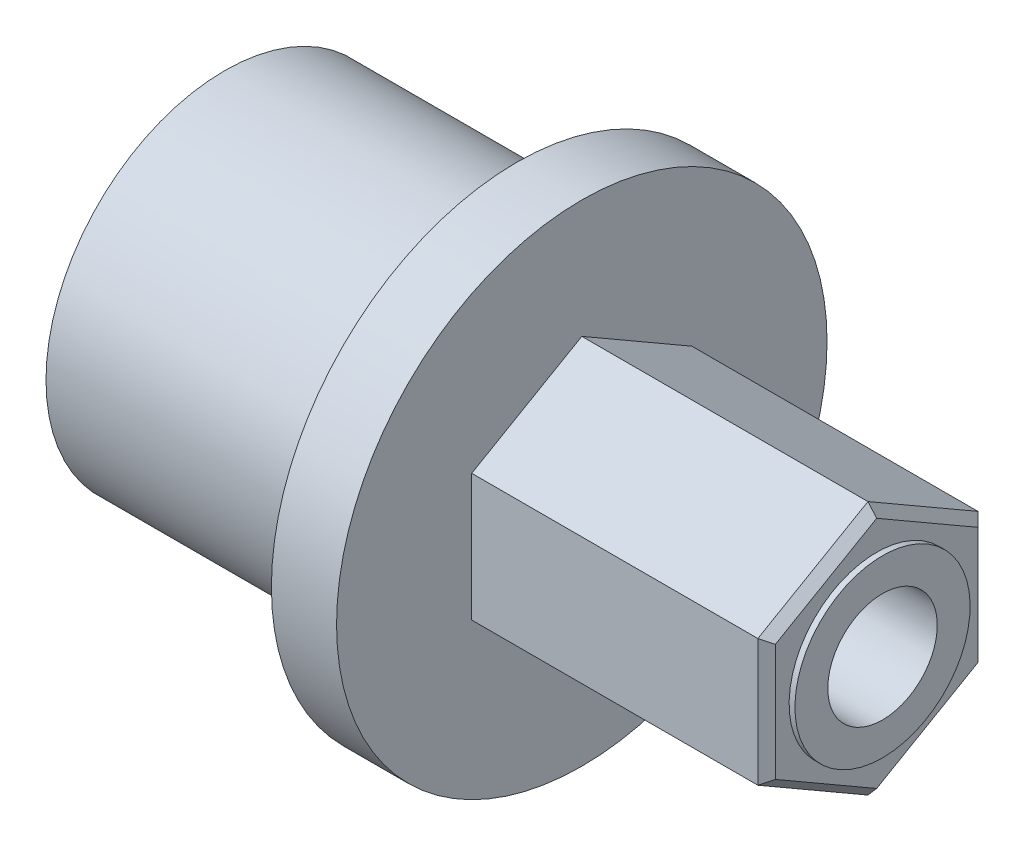
ISO-10303-21;
HEADER;
FILE_DESCRIPTION(('STEP AP214'),'2;1');
FILE_NAME('part.step','',(''),(''),'','','');
FILE_SCHEMA(('AUTOMOTIVE_DESIGN { 1 0 10303 214 1 1 1 1 }'));
ENDSEC;
DATA;
#1=APPLICATION_CONTEXT('core data for automotive mechanical design processes');
#2=APPLICATION_PROTOCOL_DEFINITION('international standard','automotive_design',2000,#1);
#3=PRODUCT_CONTEXT('',#1,'mechanical');
#4=PRODUCT('Part','Part','',(#3));
#5=PRODUCT_RELATED_PRODUCT_CATEGORY('part','',(#4));
#6=PRODUCT_DEFINITION_FORMATION('','',#4);
#7=PRODUCT_DEFINITION_CONTEXT('part definition',#1,'design');
#8=PRODUCT_DEFINITION('design','',#6,#7);
#9=PRODUCT_DEFINITION_SHAPE('','',#8);
#10=(LENGTH_UNIT() NAMED_UNIT(*) SI_UNIT(.MILLI.,.METRE.));
#11=(NAMED_UNIT(*) PLANE_ANGLE_UNIT() SI_UNIT($,.RADIAN.));
#12=(NAMED_UNIT(*) SI_UNIT($,.STERADIAN.) SOLID_ANGLE_UNIT());
#13=UNCERTAINTY_MEASURE_WITH_UNIT(LENGTH_MEASURE(1.E-05),#10,'distance_accuracy_value','');
#14=(GEOMETRIC_REPRESENTATION_CONTEXT(3) GLOBAL_UNCERTAINTY_ASSIGNED_CONTEXT((#13)) GLOBAL_UNIT_ASSIGNED_CONTEXT((#10,
#11,#12)) REPRESENTATION_CONTEXT('',''));
#15=CARTESIAN_POINT('',(0.,0.,0.));
#16=DIRECTION('',(0.,0.,1.));
#17=DIRECTION('',(1.,0.,0.));
#18=AXIS2_PLACEMENT_3D('',#15,#16,#17);
#19=CARTESIAN_POINT('',(-12.8778,10.668,0.));
#20=DIRECTION('',(-1.,0.,0.));
#21=DIRECTION('',(0.,-1.,0.));
#22=AXIS2_PLACEMENT_3D('',#19,#20,#21);
#23=PLANE('',#22);
#24=CARTESIAN_POINT('',(-12.8778,0.,0.));
#25=DIRECTION('',(-1.,0.,0.));
#26=DIRECTION('',(0.,-1.,0.));
#27=AXIS2_PLACEMENT_3D('',#24,#25,#26);
#28=CIRCLE('',#27,10.668);
#29=CARTESIAN_POINT('',(-12.8778,-10.668,0.));
#30=VERTEX_POINT('',#29);
#31=EDGE_CURVE('E171',#30,#30,#28,.T.);
#32=ORIENTED_EDGE('',*,*,#31,.F.);
#33=EDGE_LOOP('',(#32));
#34=FACE_BOUND('',#33,.T.);
#35=DIRECTION('',(0.,-0.5,0.866025403784439));
#36=VECTOR('',#35,1.);
#37=CARTESIAN_POINT('',(-12.8778,5.52859070770602,0.));
#38=LINE('',#37,#36);
#39=CARTESIAN_POINT('',(-12.8778,5.52859070770602,0.));
#40=VERTEX_POINT('',#39);
#41=CARTESIAN_POINT('',(-12.8778,2.76429535385301,4.7879));
#42=VERTEX_POINT('',#41);
#43=EDGE_CURVE('E110',#40,#42,#38,.T.);
#44=ORIENTED_EDGE('',*,*,#43,.F.);
#45=DIRECTION('',(0.,0.5,0.866025403784439));
#46=VECTOR('',#45,1.);
#47=CARTESIAN_POINT('',(-12.8778,2.76429535385301,-4.7879));
#48=LINE('',#47,#46);
#49=CARTESIAN_POINT('',(-12.8778,2.76429535385301,-4.7879));
#50=VERTEX_POINT('',#49);
#51=EDGE_CURVE('E121',#50,#40,#48,.T.);
#52=ORIENTED_EDGE('',*,*,#51,.F.);
#53=DIRECTION('',(0.,1.,0.));
#54=VECTOR('',#53,1.);
#55=CARTESIAN_POINT('',(-12.8778,-2.76429535385301,-4.7879));
#56=LINE('',#55,#54);
#57=CARTESIAN_POINT('',(-12.8778,-2.76429535385301,-4.7879));
#58=VERTEX_POINT('',#57);
#59=EDGE_CURVE('E136',#58,#50,#56,.T.);
#60=ORIENTED_EDGE('',*,*,#59,.F.);
#61=DIRECTION('',(0.,0.5,-0.866025403784439));
#62=VECTOR('',#61,1.);
#63=CARTESIAN_POINT('',(-12.8778,-5.52859070770602,0.));
#64=LINE('',#63,#62);
#65=CARTESIAN_POINT('',(-12.8778,-5.52859070770602,0.));
#66=VERTEX_POINT('',#65);
#67=EDGE_CURVE('E141',#66,#58,#64,.T.);
#68=ORIENTED_EDGE('',*,*,#67,.F.);
#69=DIRECTION('',(0.,-0.5,-0.866025403784439));
#70=VECTOR('',#69,1.);
#71=CARTESIAN_POINT('',(-12.8778,-2.76429535385301,4.7879));
#72=LINE('',#71,#70);
#73=CARTESIAN_POINT('',(-12.8778,-2.76429535385301,4.7879));
#74=VERTEX_POINT('',#73);
#75=EDGE_CURVE('E145',#74,#66,#72,.T.);
#76=ORIENTED_EDGE('',*,*,#75,.F.);
#77=DIRECTION('',(0.,-1.,0.));
#78=VECTOR('',#77,1.);
#79=CARTESIAN_POINT('',(-12.8778,2.76429535385301,4.7879));
#80=LINE('',#79,#78);
#81=EDGE_CURVE('E125',#42,#74,#80,.T.);
#82=ORIENTED_EDGE('',*,*,#81,.F.);
#83=EDGE_LOOP('',(#44,#52,#60,#68,#76,#82));
#84=FACE_BOUND('',#83,.T.);
#85=ADVANCED_FACE('F35',(#34,#84),#23,.F.);
#86=CARTESIAN_POINT('',(-22.598839252879,0.,0.));
#87=DIRECTION('',(-1.,0.,0.));
#88=DIRECTION('',(0.,-1.,0.));
#89=AXIS2_PLACEMENT_3D('',#86,#87,#88);
#90=CYLINDRICAL_SURFACE('',#89,3.81);
#91=CARTESIAN_POINT('',(0.203200000000001,0.,0.));
#92=DIRECTION('',(-1.,0.,0.));
#93=DIRECTION('',(0.,-1.,0.));
#94=AXIS2_PLACEMENT_3D('',#91,#92,#93);
#95=CIRCLE('',#94,3.81);
#96=CARTESIAN_POINT('',(0.203200000000001,-3.81,0.));
#97=VERTEX_POINT('',#96);
#98=EDGE_CURVE('E168',#97,#97,#95,.T.);
#99=ORIENTED_EDGE('',*,*,#98,.T.);
#100=EDGE_LOOP('',(#99));
#101=FACE_BOUND('',#100,.T.);
#102=CARTESIAN_POINT('',(-0.0508000000000002,0.,0.));
#103=DIRECTION('',(-1.,0.,0.));
#104=DIRECTION('',(0.,-1.,0.));
#105=AXIS2_PLACEMENT_3D('',#102,#103,#104);
#106=CIRCLE('',#105,3.81);
#107=CARTESIAN_POINT('',(-0.0507999999999997,-3.81,0.));
#108=VERTEX_POINT('',#107);
#109=EDGE_CURVE('E174',#108,#108,#106,.T.);
#110=ORIENTED_EDGE('',*,*,#109,.F.);
#111=EDGE_LOOP('',(#110));
#112=FACE_BOUND('',#111,.T.);
#113=ADVANCED_FACE('F252',(#101,#112),#90,.T.);
#114=CARTESIAN_POINT('',(-22.598839252879,0.,0.));
#115=DIRECTION('',(-1.,0.,0.));
#116=DIRECTION('',(0.,-1.,0.));
#117=AXIS2_PLACEMENT_3D('',#114,#115,#116);
#118=CYLINDRICAL_SURFACE('',#117,10.668);
#119=CARTESIAN_POINT('',(-15.7121190817378,0.,0.));
#120=DIRECTION('',(-1.,0.,0.));
#121=DIRECTION('',(0.,-1.,0.));
#122=AXIS2_PLACEMENT_3D('',#119,#120,#121);
#123=CIRCLE('',#122,10.668);
#124=CARTESIAN_POINT('',(-15.7121190817378,-10.668,0.));
#125=VERTEX_POINT('',#124);
#126=EDGE_CURVE('E131',#125,#125,#123,.T.);
#127=ORIENTED_EDGE('',*,*,#126,.F.);
#128=EDGE_LOOP('',(#127));
#129=FACE_BOUND('',#128,.T.);
#130=ORIENTED_EDGE('',*,*,#31,.T.);
#131=EDGE_LOOP('',(#130));
#132=FACE_BOUND('',#131,.T.);
#133=ADVANCED_FACE('F258',(#129,#132),#118,.T.);
#134=CARTESIAN_POINT('',(0.2032,3.81,0.));
#135=DIRECTION('',(-1.,0.,0.));
#136=DIRECTION('',(0.,-1.,0.));
#137=AXIS2_PLACEMENT_3D('',#134,#135,#136);
#138=PLANE('',#137);
#139=ORIENTED_EDGE('',*,*,#98,.F.);
#140=EDGE_LOOP('',(#139));
#141=FACE_BOUND('',#140,.T.);
#142=CARTESIAN_POINT('',(0.203200000000001,0.,0.));
#143=DIRECTION('',(-1.,0.,0.));
#144=DIRECTION('',(0.,-1.,0.));
#145=AXIS2_PLACEMENT_3D('',#142,#143,#144);
#146=CIRCLE('',#145,2.38125);
#147=CARTESIAN_POINT('',(0.203200000000001,-2.38125,0.));
#148=VERTEX_POINT('',#147);
#149=EDGE_CURVE('E165',#148,#148,#146,.T.);
#150=ORIENTED_EDGE('',*,*,#149,.T.);
#151=EDGE_LOOP('',(#150));
#152=FACE_BOUND('',#151,.T.);
#153=ADVANCED_FACE('F266',(#141,#152),#138,.F.);
#154=CARTESIAN_POINT('',(-22.598839252879,0.,0.));
#155=DIRECTION('',(-1.,0.,0.));
#156=DIRECTION('',(0.,-1.,0.));
#157=AXIS2_PLACEMENT_3D('',#154,#155,#156);
#158=CYLINDRICAL_SURFACE('',#157,2.38125);
#159=ORIENTED_EDGE('',*,*,#149,.F.);
#160=EDGE_LOOP('',(#159));
#161=FACE_BOUND('',#160,.T.);
#162=CARTESIAN_POINT('',(-24.0369690817378,0.,0.));
#163=DIRECTION('',(-1.,0.,0.));
#164=DIRECTION('',(0.,-1.,0.));
#165=AXIS2_PLACEMENT_3D('',#162,#163,#164);
#166=CIRCLE('',#165,2.38125);
#167=CARTESIAN_POINT('',(-24.0369690817378,-2.38125,0.));
#168=VERTEX_POINT('',#167);
#169=EDGE_CURVE('E162',#168,#168,#166,.T.);
#170=ORIENTED_EDGE('',*,*,#169,.T.);
#171=EDGE_LOOP('',(#170));
#172=FACE_BOUND('',#171,.T.);
#173=ADVANCED_FACE('F305',(#161,#172),#158,.F.);
#174=CARTESIAN_POINT('',(-28.4121190817378,0.,0.));
#175=DIRECTION('',(-1.,0.,0.));
#176=DIRECTION('',(0.,-1.,0.));
#177=AXIS2_PLACEMENT_3D('',#174,#175,#176);
#178=CONICAL_SURFACE('',#177,6.7564,0.78539816339745);
#179=ORIENTED_EDGE('',*,*,#169,.F.);
#180=EDGE_LOOP('',(#179));
#181=FACE_BOUND('',#180,.T.);
#182=CARTESIAN_POINT('',(-28.4121190817378,0.,0.));
#183=DIRECTION('',(-1.,0.,0.));
#184=DIRECTION('',(0.,-1.,0.));
#185=AXIS2_PLACEMENT_3D('',#182,#183,#184);
#186=CIRCLE('',#185,6.7564);
#187=CARTESIAN_POINT('',(-28.4121190817378,-6.7564,0.));
#188=VERTEX_POINT('',#187);
#189=EDGE_CURVE('E159',#188,#188,#186,.T.);
#190=ORIENTED_EDGE('',*,*,#189,.T.);
#191=EDGE_LOOP('',(#190));
#192=FACE_BOUND('',#191,.T.);
#193=ADVANCED_FACE('F301',(#181,#192),#178,.F.);
#194=CARTESIAN_POINT('',(-28.4121190817378,7.7724,0.));
#195=DIRECTION('',(1.,0.,0.));
#196=DIRECTION('',(0.,1.,0.));
#197=AXIS2_PLACEMENT_3D('',#194,#195,#196);
#198=PLANE('',#197);
#199=ORIENTED_EDGE('',*,*,#189,.F.);
#200=EDGE_LOOP('',(#199));
#201=FACE_BOUND('',#200,.T.);
#202=CARTESIAN_POINT('',(-28.4121190817378,0.,0.));
#203=DIRECTION('',(-1.,0.,0.));
#204=DIRECTION('',(0.,-1.,0.));
#205=AXIS2_PLACEMENT_3D('',#202,#203,#204);
#206=CIRCLE('',#205,7.7724);
#207=CARTESIAN_POINT('',(-28.4121190817378,-7.7724,0.));
#208=VERTEX_POINT('',#207);
#209=EDGE_CURVE('E156',#208,#208,#206,.T.);
#210=ORIENTED_EDGE('',*,*,#209,.T.);
#211=EDGE_LOOP('',(#210));
#212=FACE_BOUND('',#211,.T.);
#213=ADVANCED_FACE('F297',(#201,#212),#198,.F.);
#214=CARTESIAN_POINT('',(-22.598839252879,0.,0.));
#215=DIRECTION('',(-1.,0.,0.));
#216=DIRECTION('',(0.,-1.,0.));
#217=AXIS2_PLACEMENT_3D('',#214,#215,#216);
#218=CYLINDRICAL_SURFACE('',#217,7.7724);
#219=ORIENTED_EDGE('',*,*,#209,.F.);
#220=EDGE_LOOP('',(#219));
#221=FACE_BOUND('',#220,.T.);
#222=CARTESIAN_POINT('',(-15.7121190817378,0.,0.));
#223=DIRECTION('',(-1.,0.,0.));
#224=DIRECTION('',(0.,-1.,0.));
#225=AXIS2_PLACEMENT_3D('',#222,#223,#224);
#226=CIRCLE('',#225,7.7724);
#227=CARTESIAN_POINT('',(-15.7121190817378,-7.7724,0.));
#228=VERTEX_POINT('',#227);
#229=EDGE_CURVE('E134',#228,#228,#226,.T.);
#230=ORIENTED_EDGE('',*,*,#229,.T.);
#231=EDGE_LOOP('',(#230));
#232=FACE_BOUND('',#231,.T.);
#233=ADVANCED_FACE('F293',(#221,#232),#218,.T.);
#234=CARTESIAN_POINT('',(-15.7121190817378,7.7724,0.));
#235=DIRECTION('',(1.,0.,0.));
#236=DIRECTION('',(0.,1.,0.));
#237=AXIS2_PLACEMENT_3D('',#234,#235,#236);
#238=PLANE('',#237);
#239=ORIENTED_EDGE('',*,*,#229,.F.);
#240=EDGE_LOOP('',(#239));
#241=FACE_BOUND('',#240,.T.);
#242=ORIENTED_EDGE('',*,*,#126,.T.);
#243=EDGE_LOOP('',(#242));
#244=FACE_BOUND('',#243,.T.);
#245=ADVANCED_FACE('F249',(#241,#244),#238,.F.);
#246=CARTESIAN_POINT('',(14.8304761132527,5.52859070770602,0.));
#247=DIRECTION('',(0.,-0.866025403784439,-0.5));
#248=DIRECTION('',(0.,0.5,-0.866025403784439));
#249=AXIS2_PLACEMENT_3D('',#246,#247,#248);
#250=PLANE('',#249);
#251=DIRECTION('',(-1.,0.,0.));
#252=VECTOR('',#251,1.);
#253=CARTESIAN_POINT('',(14.8304761132527,2.76429535385301,4.7879));
#254=LINE('',#253,#252);
#255=CARTESIAN_POINT('',(-0.431799999999993,2.76429535385301,4.7879));
#256=VERTEX_POINT('',#255);
#257=EDGE_CURVE('E126',#256,#42,#254,.T.);
#258=ORIENTED_EDGE('',*,*,#257,.F.);
#259=DIRECTION('',(0.,0.5,-0.866025403784439));
#260=VECTOR('',#259,1.);
#261=CARTESIAN_POINT('',(-0.431799999999993,5.52859070770602,0.));
#262=LINE('',#261,#260);
#263=CARTESIAN_POINT('',(-0.431799999999993,5.52859070770602,0.));
#264=VERTEX_POINT('',#263);
#265=EDGE_CURVE('E12',#256,#264,#262,.T.);
#266=ORIENTED_EDGE('',*,*,#265,.T.);
#267=DIRECTION('',(-1.,0.,0.));
#268=VECTOR('',#267,1.);
#269=CARTESIAN_POINT('',(14.8304761132527,5.52859070770602,0.));
#270=LINE('',#269,#268);
#271=EDGE_CURVE('E107',#264,#40,#270,.T.);
#272=ORIENTED_EDGE('',*,*,#271,.T.);
#273=ORIENTED_EDGE('',*,*,#43,.T.);
#274=EDGE_LOOP('',(#258,#266,#272,#273));
#275=FACE_BOUND('',#274,.T.);
#276=ADVANCED_FACE('F109',(#275),#250,.F.);
#277=CARTESIAN_POINT('',(14.8304761132527,2.76429535385301,4.7879));
#278=DIRECTION('',(0.,0.,-1.));
#279=DIRECTION('',(-1.,0.,0.));
#280=AXIS2_PLACEMENT_3D('',#277,#278,#279);
#281=PLANE('',#280);
#282=DIRECTION('',(-1.,0.,0.));
#283=VECTOR('',#282,1.);
#284=CARTESIAN_POINT('',(14.8304761132527,-2.764295353853,4.7879));
#285=LINE('',#284,#283);
#286=CARTESIAN_POINT('',(-0.431799999999993,-2.76429535385301,4.7879));
#287=VERTEX_POINT('',#286);
#288=EDGE_CURVE('E148',#287,#74,#285,.T.);
#289=ORIENTED_EDGE('',*,*,#288,.F.);
#290=DIRECTION('',(0.,1.,0.));
#291=VECTOR('',#290,1.);
#292=CARTESIAN_POINT('',(-0.431799999999993,2.76429535385301,4.7879));
#293=LINE('',#292,#291);
#294=EDGE_CURVE('E44',#287,#256,#293,.T.);
#295=ORIENTED_EDGE('',*,*,#294,.T.);
#296=ORIENTED_EDGE('',*,*,#257,.T.);
#297=ORIENTED_EDGE('',*,*,#81,.T.);
#298=EDGE_LOOP('',(#289,#295,#296,#297));
#299=FACE_BOUND('',#298,.T.);
#300=ADVANCED_FACE('F241',(#299),#281,.F.);
#301=CARTESIAN_POINT('',(14.8304761132527,-2.764295353853,4.7879));
#302=DIRECTION('',(0.,0.866025403784439,-0.5));
#303=DIRECTION('',(0.,0.5,0.866025403784439));
#304=AXIS2_PLACEMENT_3D('',#301,#302,#303);
#305=PLANE('',#304);
#306=DIRECTION('',(-1.,0.,0.));
#307=VECTOR('',#306,1.);
#308=CARTESIAN_POINT('',(14.8304761132527,-5.52859070770601,0.));
#309=LINE('',#308,#307);
#310=CARTESIAN_POINT('',(-0.431799999999993,-5.52859070770601,0.));
#311=VERTEX_POINT('',#310);
#312=EDGE_CURVE('E144',#311,#66,#309,.T.);
#313=ORIENTED_EDGE('',*,*,#312,.F.);
#314=DIRECTION('',(0.,0.5,0.866025403784439));
#315=VECTOR('',#314,1.);
#316=CARTESIAN_POINT('',(-0.431799999999993,-2.76429535385301,4.7879));
#317=LINE('',#316,#315);
#318=EDGE_CURVE('E59',#311,#287,#317,.T.);
#319=ORIENTED_EDGE('',*,*,#318,.T.);
#320=ORIENTED_EDGE('',*,*,#288,.T.);
#321=ORIENTED_EDGE('',*,*,#75,.T.);
#322=EDGE_LOOP('',(#313,#319,#320,#321));
#323=FACE_BOUND('',#322,.T.);
#324=ADVANCED_FACE('F240',(#323),#305,.F.);
#325=CARTESIAN_POINT('',(14.8304761132527,-5.52859070770601,0.));
#326=DIRECTION('',(0.,0.866025403784439,0.5));
#327=DIRECTION('',(0.,-0.5,0.866025403784439));
#328=AXIS2_PLACEMENT_3D('',#325,#326,#327);
#329=PLANE('',#328);
#330=DIRECTION('',(-1.,0.,0.));
#331=VECTOR('',#330,1.);
#332=CARTESIAN_POINT('',(14.8304761132527,-2.764295353853,-4.7879));
#333=LINE('',#332,#331);
#334=CARTESIAN_POINT('',(-0.431799999999991,-2.76429535385301,-4.7879));
#335=VERTEX_POINT('',#334);
#336=EDGE_CURVE('E140',#335,#58,#333,.T.);
#337=ORIENTED_EDGE('',*,*,#336,.F.);
#338=DIRECTION('',(0.,-0.5,0.866025403784439));
#339=VECTOR('',#338,1.);
#340=CARTESIAN_POINT('',(-0.431799999999991,-5.52859070770601,0.));
#341=LINE('',#340,#339);
#342=EDGE_CURVE('E194',#335,#311,#341,.T.);
#343=ORIENTED_EDGE('',*,*,#342,.T.);
#344=ORIENTED_EDGE('',*,*,#312,.T.);
#345=ORIENTED_EDGE('',*,*,#67,.T.);
#346=EDGE_LOOP('',(#337,#343,#344,#345));
#347=FACE_BOUND('',#346,.T.);
#348=ADVANCED_FACE('F239',(#347),#329,.F.);
#349=CARTESIAN_POINT('',(14.8304761132527,-2.764295353853,-4.7879));
#350=DIRECTION('',(0.,0.,1.));
#351=DIRECTION('',(0.,-1.,0.));
#352=AXIS2_PLACEMENT_3D('',#349,#350,#351);
#353=PLANE('',#352);
#354=DIRECTION('',(-1.,0.,0.));
#355=VECTOR('',#354,1.);
#356=CARTESIAN_POINT('',(14.8304761132527,2.76429535385301,-4.7879));
#357=LINE('',#356,#355);
#358=CARTESIAN_POINT('',(-0.431799999999993,2.76429535385301,-4.7879));
#359=VERTEX_POINT('',#358);
#360=EDGE_CURVE('E130',#359,#50,#357,.T.);
#361=ORIENTED_EDGE('',*,*,#360,.F.);
#362=DIRECTION('',(0.,-1.,0.));
#363=VECTOR('',#362,1.);
#364=CARTESIAN_POINT('',(-0.431799999999993,-2.76429535385301,-4.7879));
#365=LINE('',#364,#363);
#366=EDGE_CURVE('E192',#359,#335,#365,.T.);
#367=ORIENTED_EDGE('',*,*,#366,.T.);
#368=ORIENTED_EDGE('',*,*,#336,.T.);
#369=ORIENTED_EDGE('',*,*,#59,.T.);
#370=EDGE_LOOP('',(#361,#367,#368,#369));
#371=FACE_BOUND('',#370,.T.);
#372=ADVANCED_FACE('F235',(#371),#353,.F.);
#373=CARTESIAN_POINT('',(14.8304761132527,2.76429535385301,-4.7879));
#374=DIRECTION('',(0.,-0.866025403784439,0.5));
#375=DIRECTION('',(0.,-0.5,-0.866025403784439));
#376=AXIS2_PLACEMENT_3D('',#373,#374,#375);
#377=PLANE('',#376);
#378=ORIENTED_EDGE('',*,*,#271,.F.);
#379=DIRECTION('',(0.,-0.5,-0.866025403784439));
#380=VECTOR('',#379,1.);
#381=CARTESIAN_POINT('',(-0.431799999999993,2.76429535385301,-4.7879));
#382=LINE('',#381,#380);
#383=EDGE_CURVE('E177',#264,#359,#382,.T.);
#384=ORIENTED_EDGE('',*,*,#383,.T.);
#385=ORIENTED_EDGE('',*,*,#360,.T.);
#386=ORIENTED_EDGE('',*,*,#51,.T.);
#387=EDGE_LOOP('',(#378,#384,#385,#386));
#388=FACE_BOUND('',#387,.T.);
#389=ADVANCED_FACE('F128',(#388),#377,.F.);
#390=CARTESIAN_POINT('',(-0.0507999999999998,3.81,0.));
#391=DIRECTION('',(-1.,0.,0.));
#392=DIRECTION('',(0.,-1.,0.));
#393=AXIS2_PLACEMENT_3D('',#390,#391,#392);
#394=PLANE('',#393);
#395=DIRECTION('',(0.,1.,0.));
#396=VECTOR('',#395,1.);
#397=CARTESIAN_POINT('',(-0.0507999999999998,3.81,-4.4069));
#398=LINE('',#397,#396);
#399=CARTESIAN_POINT('',(-0.0507999999999991,-2.54432490129176,-4.40690000000001));
#400=VERTEX_POINT('',#399);
#401=CARTESIAN_POINT('',(-0.0507999999999997,2.54432490129177,-4.4069));
#402=VERTEX_POINT('',#401);
#403=EDGE_CURVE('E187',#400,#402,#398,.T.);
#404=ORIENTED_EDGE('',*,*,#403,.T.);
#405=DIRECTION('',(0.,0.5,0.866025403784439));
#406=VECTOR('',#405,1.);
#407=CARTESIAN_POINT('',(-0.0507999999999999,4.76898735193765,-0.553671605790646));
#408=LINE('',#407,#406);
#409=CARTESIAN_POINT('',(-0.0507999999999999,5.08864980258353,0.));
#410=VERTEX_POINT('',#409);
#411=EDGE_CURVE('E189',#402,#410,#408,.T.);
#412=ORIENTED_EDGE('',*,*,#411,.T.);
#413=DIRECTION('',(0.,-0.5,0.866025403784439));
#414=VECTOR('',#413,1.);
#415=CARTESIAN_POINT('',(-0.0507999999999999,4.76898735193765,0.553671605790646));
#416=LINE('',#415,#414);
#417=CARTESIAN_POINT('',(-0.0507999999999997,2.54432490129177,4.4069));
#418=VERTEX_POINT('',#417);
#419=EDGE_CURVE('E179',#410,#418,#416,.T.);
#420=ORIENTED_EDGE('',*,*,#419,.T.);
#421=DIRECTION('',(0.,-1.,0.));
#422=VECTOR('',#421,1.);
#423=CARTESIAN_POINT('',(-0.0507999999999998,3.81,4.4069));
#424=LINE('',#423,#422);
#425=CARTESIAN_POINT('',(-0.0507999999999991,-2.54432490129176,4.4069));
#426=VERTEX_POINT('',#425);
#427=EDGE_CURVE('E181',#418,#426,#424,.T.);
#428=ORIENTED_EDGE('',*,*,#427,.T.);
#429=DIRECTION('',(0.,-0.5,-0.866025403784439));
#430=VECTOR('',#429,1.);
#431=CARTESIAN_POINT('',(-0.050799999999999,-2.86398735193764,3.85322839420936));
#432=LINE('',#431,#430);
#433=CARTESIAN_POINT('',(-0.0507999999999988,-5.08864980258353,0.));
#434=VERTEX_POINT('',#433);
#435=EDGE_CURVE('E183',#426,#434,#432,.T.);
#436=ORIENTED_EDGE('',*,*,#435,.T.);
#437=DIRECTION('',(0.,0.5,-0.866025403784439));
#438=VECTOR('',#437,1.);
#439=CARTESIAN_POINT('',(-0.050799999999999,-2.86398735193765,-3.85322839420936));
#440=LINE('',#439,#438);
#441=EDGE_CURVE('E185',#434,#400,#440,.T.);
#442=ORIENTED_EDGE('',*,*,#441,.T.);
#443=EDGE_LOOP('',(#404,#412,#420,#428,#436,#442));
#444=FACE_BOUND('',#443,.T.);
#445=ORIENTED_EDGE('',*,*,#109,.T.);
#446=EDGE_LOOP('',(#445));
#447=FACE_BOUND('',#446,.T.);
#448=ADVANCED_FACE('F222',(#444,#447),#394,.F.);
#449=CARTESIAN_POINT('',(-0.431799999999993,-2.76429535385301,4.7879));
#450=DIRECTION('',(-0.707106781186546,0.612372435695795,-0.353553390593274));
#451=DIRECTION('',(0.,0.5,0.866025403784439));
#452=AXIS2_PLACEMENT_3D('',#449,#450,#451);
#453=PLANE('',#452);
#454=DIRECTION('',(0.654653670707978,0.755928946018454,0.));
#455=VECTOR('',#454,1.);
#456=CARTESIAN_POINT('',(0.93617142857144,-3.94899336264715,0.));
#457=LINE('',#456,#455);
#458=EDGE_CURVE('E207',#434,#311,#457,.F.);
#459=ORIENTED_EDGE('',*,*,#458,.F.);
#460=ORIENTED_EDGE('',*,*,#435,.F.);
#461=DIRECTION('',(0.654653670707977,0.377964473009225,-0.654653670707978));
#462=VECTOR('',#461,1.);
#463=CARTESIAN_POINT('',(0.936171428571428,-1.97449668132358,3.41992857142858));
#464=LINE('',#463,#462);
#465=EDGE_CURVE('E39',#287,#426,#464,.T.);
#466=ORIENTED_EDGE('',*,*,#465,.F.);
#467=ORIENTED_EDGE('',*,*,#318,.F.);
#468=EDGE_LOOP('',(#459,#460,#466,#467));
#469=FACE_BOUND('',#468,.T.);
#470=ADVANCED_FACE('F37',(#469),#453,.F.);
#471=CARTESIAN_POINT('',(-0.431799999999993,2.76429535385301,4.7879));
#472=DIRECTION('',(-0.707106781186548,0.,-0.707106781186547));
#473=DIRECTION('',(0.,1.,0.));
#474=AXIS2_PLACEMENT_3D('',#471,#472,#473);
#475=PLANE('',#474);
#476=ORIENTED_EDGE('',*,*,#465,.T.);
#477=ORIENTED_EDGE('',*,*,#427,.F.);
#478=DIRECTION('',(0.654653670707977,-0.377964473009228,-0.654653670707977));
#479=VECTOR('',#478,1.);
#480=CARTESIAN_POINT('',(0.936171428571433,1.97449668132358,3.41992857142857));
#481=LINE('',#480,#479);
#482=EDGE_CURVE('E205',#256,#418,#481,.T.);
#483=ORIENTED_EDGE('',*,*,#482,.F.);
#484=ORIENTED_EDGE('',*,*,#294,.F.);
#485=EDGE_LOOP('',(#476,#477,#483,#484));
#486=FACE_BOUND('',#485,.T.);
#487=ADVANCED_FACE('F217',(#486),#475,.F.);
#488=CARTESIAN_POINT('',(-0.431799999999991,-5.52859070770601,0.));
#489=DIRECTION('',(-0.707106781186547,0.612372435695795,0.353553390593274));
#490=DIRECTION('',(0.,-0.5,0.866025403784439));
#491=AXIS2_PLACEMENT_3D('',#488,#489,#490);
#492=PLANE('',#491);
#493=ORIENTED_EDGE('',*,*,#458,.T.);
#494=ORIENTED_EDGE('',*,*,#342,.F.);
#495=DIRECTION('',(0.654653670707978,0.377964473009227,0.654653670707977));
#496=VECTOR('',#495,1.);
#497=CARTESIAN_POINT('',(0.936171428571437,-1.97449668132358,-3.41992857142857));
#498=LINE('',#497,#496);
#499=EDGE_CURVE('E202',#400,#335,#498,.F.);
#500=ORIENTED_EDGE('',*,*,#499,.F.);
#501=ORIENTED_EDGE('',*,*,#441,.F.);
#502=EDGE_LOOP('',(#493,#494,#500,#501));
#503=FACE_BOUND('',#502,.T.);
#504=ADVANCED_FACE('F276',(#503),#492,.F.);
#505=CARTESIAN_POINT('',(-0.431799999999993,5.52859070770602,0.));
#506=DIRECTION('',(-0.707106781186548,-0.612372435695794,-0.353553390593273));
#507=DIRECTION('',(0.,0.5,-0.866025403784439));
#508=AXIS2_PLACEMENT_3D('',#505,#506,#507);
#509=PLANE('',#508);
#510=ORIENTED_EDGE('',*,*,#482,.T.);
#511=ORIENTED_EDGE('',*,*,#419,.F.);
#512=DIRECTION('',(-0.654653670707977,0.755928946018455,0.));
#513=VECTOR('',#512,1.);
#514=CARTESIAN_POINT('',(-0.431799999999993,5.52859070770602,0.));
#515=LINE('',#514,#513);
#516=EDGE_CURVE('E200',#264,#410,#515,.F.);
#517=ORIENTED_EDGE('',*,*,#516,.F.);
#518=ORIENTED_EDGE('',*,*,#265,.F.);
#519=EDGE_LOOP('',(#510,#511,#517,#518));
#520=FACE_BOUND('',#519,.T.);
#521=ADVANCED_FACE('F228',(#520),#509,.F.);
#522=CARTESIAN_POINT('',(-0.431799999999993,-2.76429535385301,-4.7879));
#523=DIRECTION('',(-0.707106781186547,0.,0.707106781186548));
#524=DIRECTION('',(0.,-1.,0.));
#525=AXIS2_PLACEMENT_3D('',#522,#523,#524);
#526=PLANE('',#525);
#527=ORIENTED_EDGE('',*,*,#499,.T.);
#528=ORIENTED_EDGE('',*,*,#366,.F.);
#529=DIRECTION('',(0.654653670707977,-0.377964473009229,0.654653670707976));
#530=VECTOR('',#529,1.);
#531=CARTESIAN_POINT('',(0.936171428571441,1.97449668132357,-3.41992857142857));
#532=LINE('',#531,#530);
#533=EDGE_CURVE('E198',#402,#359,#532,.F.);
#534=ORIENTED_EDGE('',*,*,#533,.F.);
#535=ORIENTED_EDGE('',*,*,#403,.F.);
#536=EDGE_LOOP('',(#527,#528,#534,#535));
#537=FACE_BOUND('',#536,.T.);
#538=ADVANCED_FACE('F270',(#537),#526,.F.);
#539=CARTESIAN_POINT('',(-0.431799999999993,2.76429535385301,-4.7879));
#540=DIRECTION('',(-0.707106781186548,-0.612372435695794,0.353553390593273));
#541=DIRECTION('',(0.,-0.5,-0.866025403784439));
#542=AXIS2_PLACEMENT_3D('',#539,#540,#541);
#543=PLANE('',#542);
#544=ORIENTED_EDGE('',*,*,#516,.T.);
#545=ORIENTED_EDGE('',*,*,#411,.F.);
#546=ORIENTED_EDGE('',*,*,#533,.T.);
#547=ORIENTED_EDGE('',*,*,#383,.F.);
#548=EDGE_LOOP('',(#544,#545,#546,#547));
#549=FACE_BOUND('',#548,.T.);
#550=ADVANCED_FACE('F231',(#549),#543,.F.);
#551=CLOSED_SHELL('',(#85,#113,#133,#153,#173,#193,#213,#233,#245,#276,#300,#324,#348,#372,#389,
#448,#470,#487,#504,#521,#538,#550));
#552=MANIFOLD_SOLID_BREP('B2',#551);
#553=ADVANCED_BREP_SHAPE_REPRESENTATION('',(#18,#552),#14);
#554=SHAPE_DEFINITION_REPRESENTATION(#9,#553);
ENDSEC;
END-ISO-10303-21;
